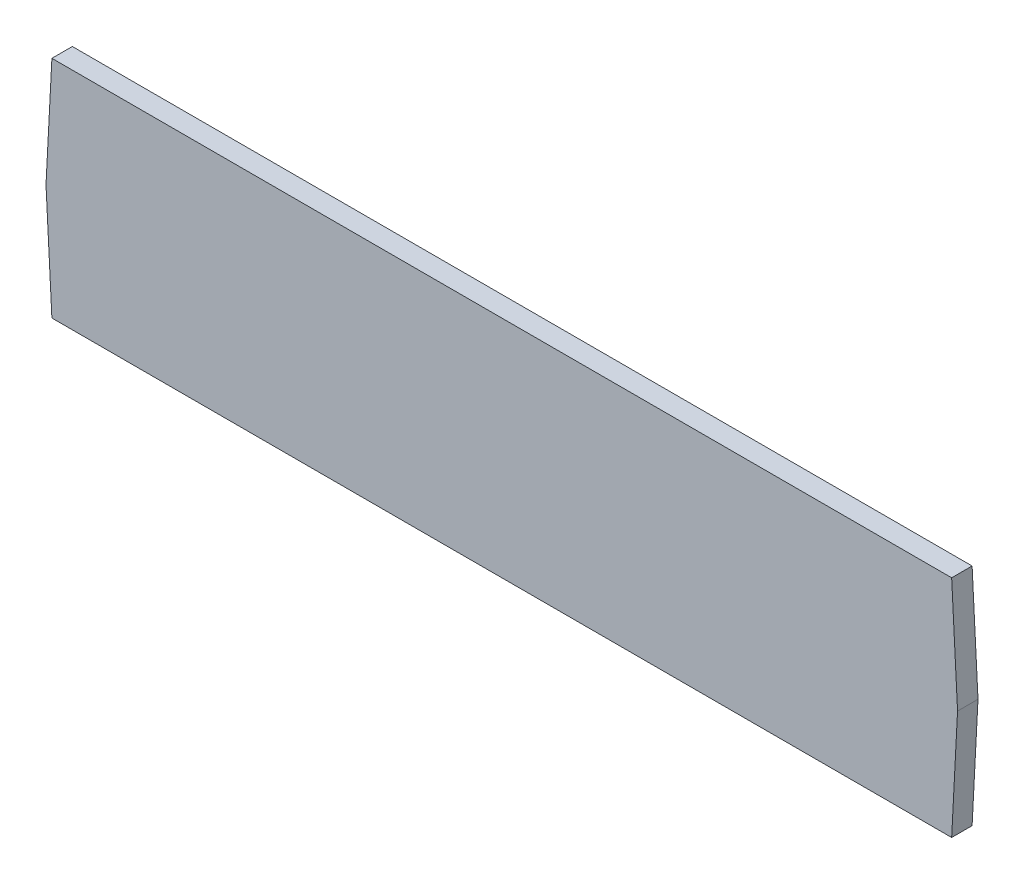
ISO-10303-21;
HEADER;
FILE_DESCRIPTION(('STEP AP214'),'2;1');
FILE_NAME('part.step','',(''),(''),'','','');
FILE_SCHEMA(('AUTOMOTIVE_DESIGN { 1 0 10303 214 1 1 1 1 }'));
ENDSEC;
DATA;
#1=APPLICATION_CONTEXT('core data for automotive mechanical design processes');
#2=APPLICATION_PROTOCOL_DEFINITION('international standard','automotive_design',2000,#1);
#3=PRODUCT_CONTEXT('',#1,'mechanical');
#4=PRODUCT('Part','Part','',(#3));
#5=PRODUCT_RELATED_PRODUCT_CATEGORY('part','',(#4));
#6=PRODUCT_DEFINITION_FORMATION('','',#4);
#7=PRODUCT_DEFINITION_CONTEXT('part definition',#1,'design');
#8=PRODUCT_DEFINITION('design','',#6,#7);
#9=PRODUCT_DEFINITION_SHAPE('','',#8);
#10=(LENGTH_UNIT() NAMED_UNIT(*) SI_UNIT(.MILLI.,.METRE.));
#11=(NAMED_UNIT(*) PLANE_ANGLE_UNIT() SI_UNIT($,.RADIAN.));
#12=(NAMED_UNIT(*) SI_UNIT($,.STERADIAN.) SOLID_ANGLE_UNIT());
#13=UNCERTAINTY_MEASURE_WITH_UNIT(LENGTH_MEASURE(1.E-05),#10,'distance_accuracy_value','');
#14=(GEOMETRIC_REPRESENTATION_CONTEXT(3) GLOBAL_UNCERTAINTY_ASSIGNED_CONTEXT((#13)) GLOBAL_UNIT_ASSIGNED_CONTEXT((#10,
#11,#12)) REPRESENTATION_CONTEXT('',''));
#15=CARTESIAN_POINT('',(0.,0.,0.));
#16=DIRECTION('',(0.,0.,1.));
#17=DIRECTION('',(1.,0.,0.));
#18=AXIS2_PLACEMENT_3D('',#15,#16,#17);
#19=CARTESIAN_POINT('',(0.,0.,3.));
#20=DIRECTION('',(0.998629534754573,-0.0523359562429594,0.));
#21=DIRECTION('',(0.0523359562429594,0.998629534754573,0.));
#22=AXIS2_PLACEMENT_3D('',#19,#20,#21);
#23=PLANE('',#22);
#24=DIRECTION('',(-0.0523359562429594,-0.998629534754573,0.));
#25=VECTOR('',#24,1.);
#26=CARTESIAN_POINT('',(0.,0.,0.));
#27=LINE('',#26,#25);
#28=CARTESIAN_POINT('',(0.,0.,0.));
#29=VERTEX_POINT('',#28);
#30=CARTESIAN_POINT('',(-0.864728358224568,-16.5000000010329,0.));
#31=VERTEX_POINT('',#30);
#32=EDGE_CURVE('E116',#29,#31,#27,.T.);
#33=ORIENTED_EDGE('',*,*,#32,.T.);
#34=DIRECTION('',(0.,0.,-1.));
#35=VECTOR('',#34,1.);
#36=CARTESIAN_POINT('',(-0.864728358224568,-16.5000000010329,3.));
#37=LINE('',#36,#35);
#38=CARTESIAN_POINT('',(-0.864728358224568,-16.5000000010329,3.));
#39=VERTEX_POINT('',#38);
#40=EDGE_CURVE('E11',#39,#31,#37,.T.);
#41=ORIENTED_EDGE('',*,*,#40,.F.);
#42=DIRECTION('',(-0.0523359562429594,-0.998629534754573,0.));
#43=VECTOR('',#42,1.);
#44=CARTESIAN_POINT('',(0.,0.,3.));
#45=LINE('',#44,#43);
#46=CARTESIAN_POINT('',(0.,0.,3.));
#47=VERTEX_POINT('',#46);
#48=EDGE_CURVE('E126',#47,#39,#45,.T.);
#49=ORIENTED_EDGE('',*,*,#48,.F.);
#50=DIRECTION('',(0.,0.,-1.));
#51=VECTOR('',#50,1.);
#52=CARTESIAN_POINT('',(0.,0.,3.));
#53=LINE('',#52,#51);
#54=EDGE_CURVE('E112',#47,#29,#53,.T.);
#55=ORIENTED_EDGE('',*,*,#54,.T.);
#56=EDGE_LOOP('',(#33,#41,#49,#55));
#57=FACE_BOUND('',#56,.T.);
#58=ADVANCED_FACE('F32',(#57),#23,.F.);
#59=CARTESIAN_POINT('',(-1.88813808338351E-13,-33.0000000020658,3.));
#60=DIRECTION('',(0.998629534754574,0.0523359562429479,0.));
#61=DIRECTION('',(-0.0523359562429479,0.998629534754574,0.));
#62=AXIS2_PLACEMENT_3D('',#59,#60,#61);
#63=PLANE('',#62);
#64=DIRECTION('',(0.0523359562429479,-0.998629534754574,0.));
#65=VECTOR('',#64,1.);
#66=CARTESIAN_POINT('',(-1.88813808338351E-13,-33.0000000020658,0.));
#67=LINE('',#66,#65);
#68=CARTESIAN_POINT('',(-1.88813808338351E-13,-33.0000000020658,0.));
#69=VERTEX_POINT('',#68);
#70=EDGE_CURVE('E119',#31,#69,#67,.T.);
#71=ORIENTED_EDGE('',*,*,#70,.T.);
#72=DIRECTION('',(0.,0.,-1.));
#73=VECTOR('',#72,1.);
#74=CARTESIAN_POINT('',(-1.88813808338351E-13,-33.0000000020658,3.));
#75=LINE('',#74,#73);
#76=CARTESIAN_POINT('',(-1.88813808338351E-13,-33.0000000020658,3.));
#77=VERTEX_POINT('',#76);
#78=EDGE_CURVE('E40',#77,#69,#75,.T.);
#79=ORIENTED_EDGE('',*,*,#78,.F.);
#80=DIRECTION('',(0.0523359562429479,-0.998629534754574,0.));
#81=VECTOR('',#80,1.);
#82=CARTESIAN_POINT('',(-1.88813808338351E-13,-33.0000000020658,3.));
#83=LINE('',#82,#81);
#84=EDGE_CURVE('E85',#39,#77,#83,.T.);
#85=ORIENTED_EDGE('',*,*,#84,.F.);
#86=ORIENTED_EDGE('',*,*,#40,.T.);
#87=EDGE_LOOP('',(#71,#79,#85,#86));
#88=FACE_BOUND('',#87,.T.);
#89=ADVANCED_FACE('F150',(#88),#63,.F.);
#90=CARTESIAN_POINT('',(132.000000000054,-33.0000000020658,3.));
#91=DIRECTION('',(0.,1.,0.));
#92=DIRECTION('',(0.,0.,1.));
#93=AXIS2_PLACEMENT_3D('',#90,#91,#92);
#94=PLANE('',#93);
#95=DIRECTION('',(1.,0.,0.));
#96=VECTOR('',#95,1.);
#97=CARTESIAN_POINT('',(132.000000000054,-33.0000000020658,0.));
#98=LINE('',#97,#96);
#99=CARTESIAN_POINT('',(132.000000000054,-33.0000000020658,0.));
#100=VERTEX_POINT('',#99);
#101=EDGE_CURVE('E121',#69,#100,#98,.T.);
#102=ORIENTED_EDGE('',*,*,#101,.T.);
#103=DIRECTION('',(0.,0.,-1.));
#104=VECTOR('',#103,1.);
#105=CARTESIAN_POINT('',(132.000000000054,-33.0000000020658,3.));
#106=LINE('',#105,#104);
#107=CARTESIAN_POINT('',(132.000000000054,-33.0000000020658,3.));
#108=VERTEX_POINT('',#107);
#109=EDGE_CURVE('E107',#108,#100,#106,.T.);
#110=ORIENTED_EDGE('',*,*,#109,.F.);
#111=DIRECTION('',(1.,0.,0.));
#112=VECTOR('',#111,1.);
#113=CARTESIAN_POINT('',(132.000000000054,-33.0000000020658,3.));
#114=LINE('',#113,#112);
#115=EDGE_CURVE('E98',#77,#108,#114,.T.);
#116=ORIENTED_EDGE('',*,*,#115,.F.);
#117=ORIENTED_EDGE('',*,*,#78,.T.);
#118=EDGE_LOOP('',(#102,#110,#116,#117));
#119=FACE_BOUND('',#118,.T.);
#120=ADVANCED_FACE('F132',(#119),#94,.F.);
#121=CARTESIAN_POINT('',(132.000000000054,-33.0000000020658,3.));
#122=DIRECTION('',(-0.998629534754574,0.0523359562429417,0.));
#123=DIRECTION('',(-0.0523359562429417,-0.998629534754574,0.));
#124=AXIS2_PLACEMENT_3D('',#121,#122,#123);
#125=PLANE('',#124);
#126=DIRECTION('',(0.0523359562429417,0.998629534754574,0.));
#127=VECTOR('',#126,1.);
#128=CARTESIAN_POINT('',(132.000000000054,-33.0000000020658,0.));
#129=LINE('',#128,#127);
#130=CARTESIAN_POINT('',(132.864728358224,-16.5000000020685,0.));
#131=VERTEX_POINT('',#130);
#132=EDGE_CURVE('E106',#100,#131,#129,.T.);
#133=ORIENTED_EDGE('',*,*,#132,.T.);
#134=DIRECTION('',(0.,0.,-1.));
#135=VECTOR('',#134,1.);
#136=CARTESIAN_POINT('',(132.864728358224,-16.5000000020685,3.));
#137=LINE('',#136,#135);
#138=CARTESIAN_POINT('',(132.864728358224,-16.5000000020685,3.));
#139=VERTEX_POINT('',#138);
#140=EDGE_CURVE('E103',#139,#131,#137,.T.);
#141=ORIENTED_EDGE('',*,*,#140,.F.);
#142=DIRECTION('',(0.0523359562429417,0.998629534754574,0.));
#143=VECTOR('',#142,1.);
#144=CARTESIAN_POINT('',(132.000000000054,-33.0000000020658,3.));
#145=LINE('',#144,#143);
#146=EDGE_CURVE('E92',#108,#139,#145,.T.);
#147=ORIENTED_EDGE('',*,*,#146,.F.);
#148=ORIENTED_EDGE('',*,*,#109,.T.);
#149=EDGE_LOOP('',(#133,#141,#147,#148));
#150=FACE_BOUND('',#149,.T.);
#151=ADVANCED_FACE('F104',(#150),#125,.F.);
#152=CARTESIAN_POINT('',(132.,0.,3.));
#153=DIRECTION('',(-0.998629534754746,-0.0523359562396637,0.));
#154=DIRECTION('',(0.0523359562396637,-0.998629534754746,0.));
#155=AXIS2_PLACEMENT_3D('',#152,#153,#154);
#156=PLANE('',#155);
#157=DIRECTION('',(-0.0523359562396637,0.998629534754746,0.));
#158=VECTOR('',#157,1.);
#159=CARTESIAN_POINT('',(132.,0.,0.));
#160=LINE('',#159,#158);
#161=CARTESIAN_POINT('',(132.,0.,0.));
#162=VERTEX_POINT('',#161);
#163=EDGE_CURVE('E71',#131,#162,#160,.T.);
#164=ORIENTED_EDGE('',*,*,#163,.T.);
#165=DIRECTION('',(0.,0.,-1.));
#166=VECTOR('',#165,1.);
#167=CARTESIAN_POINT('',(132.,0.,3.));
#168=LINE('',#167,#166);
#169=CARTESIAN_POINT('',(132.,0.,3.));
#170=VERTEX_POINT('',#169);
#171=EDGE_CURVE('E108',#170,#162,#168,.T.);
#172=ORIENTED_EDGE('',*,*,#171,.F.);
#173=DIRECTION('',(-0.0523359562396637,0.998629534754746,0.));
#174=VECTOR('',#173,1.);
#175=CARTESIAN_POINT('',(132.,0.,3.));
#176=LINE('',#175,#174);
#177=EDGE_CURVE('E96',#139,#170,#176,.T.);
#178=ORIENTED_EDGE('',*,*,#177,.F.);
#179=ORIENTED_EDGE('',*,*,#140,.T.);
#180=EDGE_LOOP('',(#164,#172,#178,#179));
#181=FACE_BOUND('',#180,.T.);
#182=ADVANCED_FACE('F110',(#181),#156,.F.);
#183=CARTESIAN_POINT('',(0.,0.,3.));
#184=DIRECTION('',(0.,-1.,0.));
#185=DIRECTION('',(0.,0.,-1.));
#186=AXIS2_PLACEMENT_3D('',#183,#184,#185);
#187=PLANE('',#186);
#188=DIRECTION('',(-1.,0.,0.));
#189=VECTOR('',#188,1.);
#190=CARTESIAN_POINT('',(0.,0.,0.));
#191=LINE('',#190,#189);
#192=EDGE_CURVE('E77',#162,#29,#191,.T.);
#193=ORIENTED_EDGE('',*,*,#192,.T.);
#194=ORIENTED_EDGE('',*,*,#54,.F.);
#195=DIRECTION('',(-1.,0.,0.));
#196=VECTOR('',#195,1.);
#197=CARTESIAN_POINT('',(0.,0.,3.));
#198=LINE('',#197,#196);
#199=EDGE_CURVE('E48',#170,#47,#198,.T.);
#200=ORIENTED_EDGE('',*,*,#199,.F.);
#201=ORIENTED_EDGE('',*,*,#171,.T.);
#202=EDGE_LOOP('',(#193,#194,#200,#201));
#203=FACE_BOUND('',#202,.T.);
#204=ADVANCED_FACE('F139',(#203),#187,.F.);
#205=CARTESIAN_POINT('',(0.,0.,3.));
#206=DIRECTION('',(0.,0.,-1.));
#207=DIRECTION('',(-1.,0.,0.));
#208=AXIS2_PLACEMENT_3D('',#205,#206,#207);
#209=PLANE('',#208);
#210=ORIENTED_EDGE('',*,*,#48,.T.);
#211=ORIENTED_EDGE('',*,*,#84,.T.);
#212=ORIENTED_EDGE('',*,*,#115,.T.);
#213=ORIENTED_EDGE('',*,*,#146,.T.);
#214=ORIENTED_EDGE('',*,*,#177,.T.);
#215=ORIENTED_EDGE('',*,*,#199,.T.);
#216=EDGE_LOOP('',(#210,#211,#212,#213,#214,#215));
#217=FACE_BOUND('',#216,.T.);
#218=ADVANCED_FACE('F94',(#217),#209,.F.);
#219=CARTESIAN_POINT('',(0.,0.,0.));
#220=DIRECTION('',(0.,0.,-1.));
#221=DIRECTION('',(-1.,0.,0.));
#222=AXIS2_PLACEMENT_3D('',#219,#220,#221);
#223=PLANE('',#222);
#224=ORIENTED_EDGE('',*,*,#32,.F.);
#225=ORIENTED_EDGE('',*,*,#192,.F.);
#226=ORIENTED_EDGE('',*,*,#163,.F.);
#227=ORIENTED_EDGE('',*,*,#132,.F.);
#228=ORIENTED_EDGE('',*,*,#101,.F.);
#229=ORIENTED_EDGE('',*,*,#70,.F.);
#230=EDGE_LOOP('',(#224,#225,#226,#227,#228,#229));
#231=FACE_BOUND('',#230,.T.);
#232=ADVANCED_FACE('F135',(#231),#223,.T.);
#233=CLOSED_SHELL('',(#58,#89,#120,#151,#182,#204,#218,#232));
#234=MANIFOLD_SOLID_BREP('B2',#233);
#235=ADVANCED_BREP_SHAPE_REPRESENTATION('',(#18,#234),#14);
#236=SHAPE_DEFINITION_REPRESENTATION(#9,#235);
ENDSEC;
END-ISO-10303-21;
